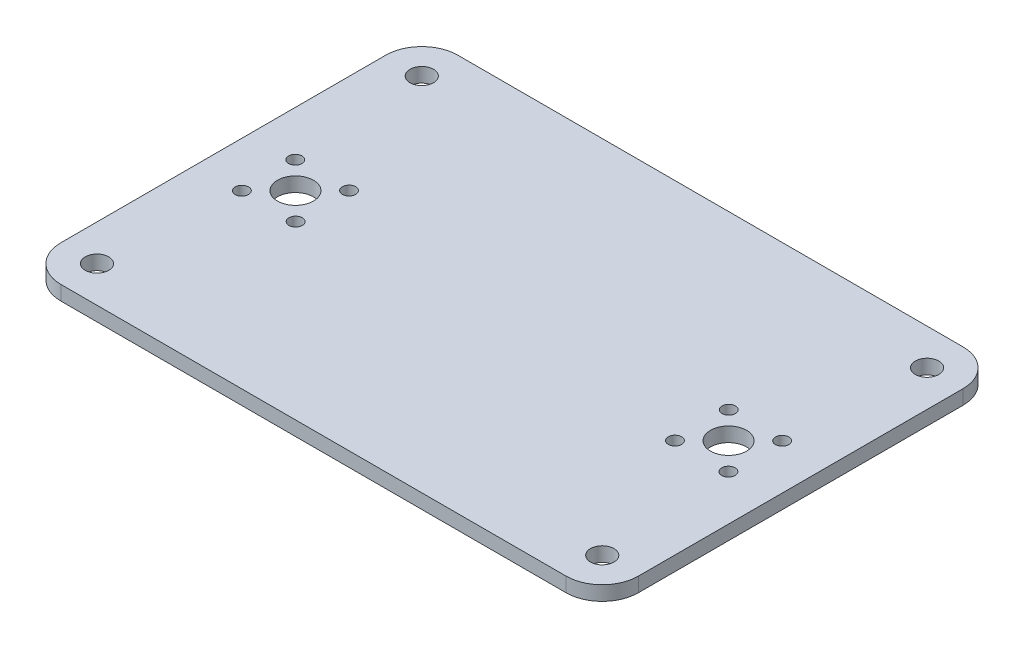
ISO-10303-21;
HEADER;
FILE_DESCRIPTION(('STEP AP214'),'2;1');
FILE_NAME('part.step','',(''),(''),'','','');
FILE_SCHEMA(('AUTOMOTIVE_DESIGN { 1 0 10303 214 1 1 1 1 }'));
ENDSEC;
DATA;
#1=APPLICATION_CONTEXT('core data for automotive mechanical design processes');
#2=APPLICATION_PROTOCOL_DEFINITION('international standard','automotive_design',2000,#1);
#3=PRODUCT_CONTEXT('',#1,'mechanical');
#4=PRODUCT('Part','Part','',(#3));
#5=PRODUCT_RELATED_PRODUCT_CATEGORY('part','',(#4));
#6=PRODUCT_DEFINITION_FORMATION('','',#4);
#7=PRODUCT_DEFINITION_CONTEXT('part definition',#1,'design');
#8=PRODUCT_DEFINITION('design','',#6,#7);
#9=PRODUCT_DEFINITION_SHAPE('','',#8);
#10=(LENGTH_UNIT() NAMED_UNIT(*) SI_UNIT(.MILLI.,.METRE.));
#11=(NAMED_UNIT(*) PLANE_ANGLE_UNIT() SI_UNIT($,.RADIAN.));
#12=(NAMED_UNIT(*) SI_UNIT($,.STERADIAN.) SOLID_ANGLE_UNIT());
#13=UNCERTAINTY_MEASURE_WITH_UNIT(LENGTH_MEASURE(1.E-05),#10,'distance_accuracy_value','');
#14=(GEOMETRIC_REPRESENTATION_CONTEXT(3) GLOBAL_UNCERTAINTY_ASSIGNED_CONTEXT((#13)) GLOBAL_UNIT_ASSIGNED_CONTEXT((#10,
#11,#12)) REPRESENTATION_CONTEXT('',''));
#15=CARTESIAN_POINT('',(0.,0.,0.));
#16=DIRECTION('',(0.,0.,1.));
#17=DIRECTION('',(1.,0.,0.));
#18=AXIS2_PLACEMENT_3D('',#15,#16,#17);
#19=CARTESIAN_POINT('',(0.,4.,-55.));
#20=DIRECTION('',(0.,0.,1.));
#21=DIRECTION('',(1.,0.,0.));
#22=AXIS2_PLACEMENT_3D('',#19,#20,#21);
#23=PLANE('',#22);
#24=DIRECTION('',(-1.,0.,0.));
#25=VECTOR('',#24,1.);
#26=CARTESIAN_POINT('',(0.,0.,-55.));
#27=LINE('',#26,#25);
#28=CARTESIAN_POINT('',(69.9999999999999,0.,-55.));
#29=VERTEX_POINT('',#28);
#30=CARTESIAN_POINT('',(-70.,0.,-55.));
#31=VERTEX_POINT('',#30);
#32=EDGE_CURVE('E185',#29,#31,#27,.T.);
#33=ORIENTED_EDGE('',*,*,#32,.T.);
#34=DIRECTION('',(0.,-1.,0.));
#35=VECTOR('',#34,1.);
#36=CARTESIAN_POINT('',(-70.,4.,-55.));
#37=LINE('',#36,#35);
#38=CARTESIAN_POINT('',(-70.,4.,-55.));
#39=VERTEX_POINT('',#38);
#40=EDGE_CURVE('E13',#39,#31,#37,.T.);
#41=ORIENTED_EDGE('',*,*,#40,.F.);
#42=DIRECTION('',(-1.,0.,0.));
#43=VECTOR('',#42,1.);
#44=CARTESIAN_POINT('',(0.,4.,-55.));
#45=LINE('',#44,#43);
#46=CARTESIAN_POINT('',(69.9999999999999,4.,-55.));
#47=VERTEX_POINT('',#46);
#48=EDGE_CURVE('E234',#47,#39,#45,.T.);
#49=ORIENTED_EDGE('',*,*,#48,.F.);
#50=DIRECTION('',(0.,-1.,0.));
#51=VECTOR('',#50,1.);
#52=CARTESIAN_POINT('',(69.9999999999999,4.,-55.));
#53=LINE('',#52,#51);
#54=EDGE_CURVE('E145',#47,#29,#53,.T.);
#55=ORIENTED_EDGE('',*,*,#54,.T.);
#56=EDGE_LOOP('',(#33,#41,#49,#55));
#57=FACE_BOUND('',#56,.T.);
#58=ADVANCED_FACE('F46',(#57),#23,.F.);
#59=CARTESIAN_POINT('',(-70.,4.,-45.));
#60=DIRECTION('',(0.,-1.,0.));
#61=DIRECTION('',(0.,0.,-1.));
#62=AXIS2_PLACEMENT_3D('',#59,#60,#61);
#63=CYLINDRICAL_SURFACE('',#62,10.);
#64=CARTESIAN_POINT('',(-70.,0.,-45.));
#65=DIRECTION('',(0.,1.,0.));
#66=DIRECTION('',(0.,0.,1.));
#67=AXIS2_PLACEMENT_3D('',#64,#65,#66);
#68=CIRCLE('',#67,10.);
#69=CARTESIAN_POINT('',(-80.,0.,-44.9999999999999));
#70=VERTEX_POINT('',#69);
#71=EDGE_CURVE('E188',#31,#70,#68,.T.);
#72=ORIENTED_EDGE('',*,*,#71,.T.);
#73=DIRECTION('',(0.,-1.,0.));
#74=VECTOR('',#73,1.);
#75=CARTESIAN_POINT('',(-80.,4.,-44.9999999999999));
#76=LINE('',#75,#74);
#77=CARTESIAN_POINT('',(-80.,4.,-44.9999999999999));
#78=VERTEX_POINT('',#77);
#79=EDGE_CURVE('E55',#78,#70,#76,.T.);
#80=ORIENTED_EDGE('',*,*,#79,.F.);
#81=CARTESIAN_POINT('',(-70.,4.,-45.));
#82=DIRECTION('',(0.,1.,0.));
#83=DIRECTION('',(0.,0.,1.));
#84=AXIS2_PLACEMENT_3D('',#81,#82,#83);
#85=CIRCLE('',#84,10.);
#86=EDGE_CURVE('E106',#39,#78,#85,.T.);
#87=ORIENTED_EDGE('',*,*,#86,.F.);
#88=ORIENTED_EDGE('',*,*,#40,.T.);
#89=EDGE_LOOP('',(#72,#80,#87,#88));
#90=FACE_BOUND('',#89,.T.);
#91=ADVANCED_FACE('F219',(#90),#63,.T.);
#92=CARTESIAN_POINT('',(-80.,4.,0.));
#93=DIRECTION('',(-1.,0.,0.));
#94=DIRECTION('',(0.,0.,1.));
#95=AXIS2_PLACEMENT_3D('',#92,#93,#94);
#96=PLANE('',#95);
#97=DIRECTION('',(0.,0.,-1.));
#98=VECTOR('',#97,1.);
#99=CARTESIAN_POINT('',(-80.,0.,0.));
#100=LINE('',#99,#98);
#101=CARTESIAN_POINT('',(-80.,0.,44.9999999999999));
#102=VERTEX_POINT('',#101);
#103=EDGE_CURVE('E191',#102,#70,#100,.T.);
#104=ORIENTED_EDGE('',*,*,#103,.F.);
#105=DIRECTION('',(0.,-1.,0.));
#106=VECTOR('',#105,1.);
#107=CARTESIAN_POINT('',(-80.,4.,44.9999999999999));
#108=LINE('',#107,#106);
#109=CARTESIAN_POINT('',(-80.,4.,44.9999999999999));
#110=VERTEX_POINT('',#109);
#111=EDGE_CURVE('E212',#110,#102,#108,.T.);
#112=ORIENTED_EDGE('',*,*,#111,.F.);
#113=DIRECTION('',(0.,0.,-1.));
#114=VECTOR('',#113,1.);
#115=CARTESIAN_POINT('',(-80.,4.,0.));
#116=LINE('',#115,#114);
#117=EDGE_CURVE('E218',#110,#78,#116,.T.);
#118=ORIENTED_EDGE('',*,*,#117,.T.);
#119=ORIENTED_EDGE('',*,*,#79,.T.);
#120=EDGE_LOOP('',(#104,#112,#118,#119));
#121=FACE_BOUND('',#120,.T.);
#122=ADVANCED_FACE('F216',(#121),#96,.T.);
#123=CARTESIAN_POINT('',(-70.,4.,45.));
#124=DIRECTION('',(0.,-1.,0.));
#125=DIRECTION('',(0.,0.,-1.));
#126=AXIS2_PLACEMENT_3D('',#123,#124,#125);
#127=CYLINDRICAL_SURFACE('',#126,10.);
#128=CARTESIAN_POINT('',(-70.,0.,45.));
#129=DIRECTION('',(0.,1.,0.));
#130=DIRECTION('',(0.,0.,1.));
#131=AXIS2_PLACEMENT_3D('',#128,#129,#130);
#132=CIRCLE('',#131,10.);
#133=CARTESIAN_POINT('',(-70.,0.,55.));
#134=VERTEX_POINT('',#133);
#135=EDGE_CURVE('E194',#102,#134,#132,.T.);
#136=ORIENTED_EDGE('',*,*,#135,.T.);
#137=DIRECTION('',(0.,-1.,0.));
#138=VECTOR('',#137,1.);
#139=CARTESIAN_POINT('',(-70.,4.,55.));
#140=LINE('',#139,#138);
#141=CARTESIAN_POINT('',(-70.,4.,55.));
#142=VERTEX_POINT('',#141);
#143=EDGE_CURVE('E210',#142,#134,#140,.T.);
#144=ORIENTED_EDGE('',*,*,#143,.F.);
#145=CARTESIAN_POINT('',(-70.,4.,45.));
#146=DIRECTION('',(0.,1.,0.));
#147=DIRECTION('',(0.,0.,1.));
#148=AXIS2_PLACEMENT_3D('',#145,#146,#147);
#149=CIRCLE('',#148,10.);
#150=EDGE_CURVE('E231',#110,#142,#149,.T.);
#151=ORIENTED_EDGE('',*,*,#150,.F.);
#152=ORIENTED_EDGE('',*,*,#111,.T.);
#153=EDGE_LOOP('',(#136,#144,#151,#152));
#154=FACE_BOUND('',#153,.T.);
#155=ADVANCED_FACE('F229',(#154),#127,.T.);
#156=CARTESIAN_POINT('',(0.,4.,55.));
#157=DIRECTION('',(0.,0.,1.));
#158=DIRECTION('',(1.,0.,0.));
#159=AXIS2_PLACEMENT_3D('',#156,#157,#158);
#160=PLANE('',#159);
#161=DIRECTION('',(-1.,0.,0.));
#162=VECTOR('',#161,1.);
#163=CARTESIAN_POINT('',(0.,0.,55.));
#164=LINE('',#163,#162);
#165=CARTESIAN_POINT('',(69.9999999999999,0.,55.));
#166=VERTEX_POINT('',#165);
#167=EDGE_CURVE('E197',#166,#134,#164,.T.);
#168=ORIENTED_EDGE('',*,*,#167,.F.);
#169=DIRECTION('',(0.,-1.,0.));
#170=VECTOR('',#169,1.);
#171=CARTESIAN_POINT('',(69.9999999999999,4.,55.));
#172=LINE('',#171,#170);
#173=CARTESIAN_POINT('',(69.9999999999999,4.,55.));
#174=VERTEX_POINT('',#173);
#175=EDGE_CURVE('E134',#174,#166,#172,.T.);
#176=ORIENTED_EDGE('',*,*,#175,.F.);
#177=DIRECTION('',(-1.,0.,0.));
#178=VECTOR('',#177,1.);
#179=CARTESIAN_POINT('',(0.,4.,55.));
#180=LINE('',#179,#178);
#181=EDGE_CURVE('E127',#174,#142,#180,.T.);
#182=ORIENTED_EDGE('',*,*,#181,.T.);
#183=ORIENTED_EDGE('',*,*,#143,.T.);
#184=EDGE_LOOP('',(#168,#176,#182,#183));
#185=FACE_BOUND('',#184,.T.);
#186=ADVANCED_FACE('F238',(#185),#160,.T.);
#187=CARTESIAN_POINT('',(70.,4.,45.));
#188=DIRECTION('',(0.,-1.,0.));
#189=DIRECTION('',(0.,0.,-1.));
#190=AXIS2_PLACEMENT_3D('',#187,#188,#189);
#191=CYLINDRICAL_SURFACE('',#190,10.);
#192=CARTESIAN_POINT('',(70.,0.,45.));
#193=DIRECTION('',(0.,1.,0.));
#194=DIRECTION('',(0.,0.,1.));
#195=AXIS2_PLACEMENT_3D('',#192,#193,#194);
#196=CIRCLE('',#195,10.);
#197=CARTESIAN_POINT('',(80.,0.,44.9999999999999));
#198=VERTEX_POINT('',#197);
#199=EDGE_CURVE('E133',#166,#198,#196,.T.);
#200=ORIENTED_EDGE('',*,*,#199,.T.);
#201=DIRECTION('',(0.,-1.,0.));
#202=VECTOR('',#201,1.);
#203=CARTESIAN_POINT('',(80.,4.,44.9999999999999));
#204=LINE('',#203,#202);
#205=CARTESIAN_POINT('',(80.,4.,44.9999999999999));
#206=VERTEX_POINT('',#205);
#207=EDGE_CURVE('E130',#206,#198,#204,.T.);
#208=ORIENTED_EDGE('',*,*,#207,.F.);
#209=CARTESIAN_POINT('',(70.,4.,45.));
#210=DIRECTION('',(0.,1.,0.));
#211=DIRECTION('',(0.,0.,1.));
#212=AXIS2_PLACEMENT_3D('',#209,#210,#211);
#213=CIRCLE('',#212,10.);
#214=EDGE_CURVE('E120',#174,#206,#213,.T.);
#215=ORIENTED_EDGE('',*,*,#214,.F.);
#216=ORIENTED_EDGE('',*,*,#175,.T.);
#217=EDGE_LOOP('',(#200,#208,#215,#216));
#218=FACE_BOUND('',#217,.T.);
#219=ADVANCED_FACE('F131',(#218),#191,.T.);
#220=CARTESIAN_POINT('',(80.,4.,0.));
#221=DIRECTION('',(-1.,0.,0.));
#222=DIRECTION('',(0.,0.,1.));
#223=AXIS2_PLACEMENT_3D('',#220,#221,#222);
#224=PLANE('',#223);
#225=DIRECTION('',(0.,0.,-1.));
#226=VECTOR('',#225,1.);
#227=CARTESIAN_POINT('',(80.,0.,0.));
#228=LINE('',#227,#226);
#229=CARTESIAN_POINT('',(80.,0.,-45.));
#230=VERTEX_POINT('',#229);
#231=EDGE_CURVE('E92',#198,#230,#228,.T.);
#232=ORIENTED_EDGE('',*,*,#231,.T.);
#233=DIRECTION('',(0.,-1.,0.));
#234=VECTOR('',#233,1.);
#235=CARTESIAN_POINT('',(80.,4.,-45.));
#236=LINE('',#235,#234);
#237=CARTESIAN_POINT('',(80.,4.,-45.));
#238=VERTEX_POINT('',#237);
#239=EDGE_CURVE('E135',#238,#230,#236,.T.);
#240=ORIENTED_EDGE('',*,*,#239,.F.);
#241=DIRECTION('',(0.,0.,-1.));
#242=VECTOR('',#241,1.);
#243=CARTESIAN_POINT('',(80.,4.,0.));
#244=LINE('',#243,#242);
#245=EDGE_CURVE('E125',#206,#238,#244,.T.);
#246=ORIENTED_EDGE('',*,*,#245,.F.);
#247=ORIENTED_EDGE('',*,*,#207,.T.);
#248=EDGE_LOOP('',(#232,#240,#246,#247));
#249=FACE_BOUND('',#248,.T.);
#250=ADVANCED_FACE('F137',(#249),#224,.F.);
#251=CARTESIAN_POINT('',(70.,4.,-45.));
#252=DIRECTION('',(0.,-1.,0.));
#253=DIRECTION('',(0.,0.,-1.));
#254=AXIS2_PLACEMENT_3D('',#251,#252,#253);
#255=CYLINDRICAL_SURFACE('',#254,10.);
#256=CARTESIAN_POINT('',(70.,0.,-45.));
#257=DIRECTION('',(0.,1.,0.));
#258=DIRECTION('',(0.,0.,1.));
#259=AXIS2_PLACEMENT_3D('',#256,#257,#258);
#260=CIRCLE('',#259,10.);
#261=EDGE_CURVE('E98',#230,#29,#260,.T.);
#262=ORIENTED_EDGE('',*,*,#261,.T.);
#263=ORIENTED_EDGE('',*,*,#54,.F.);
#264=CARTESIAN_POINT('',(70.,4.,-45.));
#265=DIRECTION('',(0.,1.,0.));
#266=DIRECTION('',(0.,0.,1.));
#267=AXIS2_PLACEMENT_3D('',#264,#265,#266);
#268=CIRCLE('',#267,10.);
#269=EDGE_CURVE('E63',#238,#47,#268,.T.);
#270=ORIENTED_EDGE('',*,*,#269,.F.);
#271=ORIENTED_EDGE('',*,*,#239,.T.);
#272=EDGE_LOOP('',(#262,#263,#270,#271));
#273=FACE_BOUND('',#272,.T.);
#274=ADVANCED_FACE('F241',(#273),#255,.T.);
#275=CARTESIAN_POINT('',(60.,4.,0.));
#276=DIRECTION('',(0.,-1.,0.));
#277=DIRECTION('',(0.,0.,-1.));
#278=AXIS2_PLACEMENT_3D('',#275,#276,#277);
#279=CYLINDRICAL_SURFACE('',#278,5.);
#280=CARTESIAN_POINT('',(60.,4.,0.));
#281=DIRECTION('',(0.,1.,0.));
#282=DIRECTION('',(0.,0.,1.));
#283=AXIS2_PLACEMENT_3D('',#280,#281,#282);
#284=CIRCLE('',#283,5.);
#285=CARTESIAN_POINT('',(60.,4.,4.99999999999997));
#286=VERTEX_POINT('',#285);
#287=EDGE_CURVE('E557',#286,#286,#284,.F.);
#288=ORIENTED_EDGE('',*,*,#287,.F.);
#289=EDGE_LOOP('',(#288));
#290=FACE_BOUND('',#289,.T.);
#291=CARTESIAN_POINT('',(60.,0.,0.));
#292=DIRECTION('',(0.,1.,0.));
#293=DIRECTION('',(0.,0.,1.));
#294=AXIS2_PLACEMENT_3D('',#291,#292,#293);
#295=CIRCLE('',#294,5.);
#296=CARTESIAN_POINT('',(60.,0.,4.99999999999997));
#297=VERTEX_POINT('',#296);
#298=EDGE_CURVE('E182',#297,#297,#295,.F.);
#299=ORIENTED_EDGE('',*,*,#298,.T.);
#300=EDGE_LOOP('',(#299));
#301=FACE_BOUND('',#300,.T.);
#302=ADVANCED_FACE('F243',(#290,#301),#279,.F.);
#303=CARTESIAN_POINT('',(52.5533596668064,4.,7.40253657525944));
#304=DIRECTION('',(0.,-1.,0.));
#305=DIRECTION('',(0.,0.,-1.));
#306=AXIS2_PLACEMENT_3D('',#303,#304,#305);
#307=CYLINDRICAL_SURFACE('',#306,1.85);
#308=CARTESIAN_POINT('',(52.5533596668064,4.,7.40253657525944));
#309=DIRECTION('',(0.,1.,0.));
#310=DIRECTION('',(0.,0.,1.));
#311=AXIS2_PLACEMENT_3D('',#308,#309,#310);
#312=CIRCLE('',#311,1.85);
#313=CARTESIAN_POINT('',(52.5533596668064,4.,9.25253657525944));
#314=VERTEX_POINT('',#313);
#315=EDGE_CURVE('E554',#314,#314,#312,.F.);
#316=ORIENTED_EDGE('',*,*,#315,.F.);
#317=EDGE_LOOP('',(#316));
#318=FACE_BOUND('',#317,.T.);
#319=CARTESIAN_POINT('',(52.5533596668064,0.,7.40253657525944));
#320=DIRECTION('',(0.,1.,0.));
#321=DIRECTION('',(0.,0.,1.));
#322=AXIS2_PLACEMENT_3D('',#319,#320,#321);
#323=CIRCLE('',#322,1.85);
#324=CARTESIAN_POINT('',(52.5533596668064,0.,9.25253657525944));
#325=VERTEX_POINT('',#324);
#326=EDGE_CURVE('E179',#325,#325,#323,.F.);
#327=ORIENTED_EDGE('',*,*,#326,.T.);
#328=EDGE_LOOP('',(#327));
#329=FACE_BOUND('',#328,.T.);
#330=ADVANCED_FACE('F249',(#318,#329),#307,.F.);
#331=CARTESIAN_POINT('',(-52.5533596668064,4.,7.40253657525945));
#332=DIRECTION('',(0.,-1.,0.));
#333=DIRECTION('',(0.,0.,-1.));
#334=AXIS2_PLACEMENT_3D('',#331,#332,#333);
#335=CYLINDRICAL_SURFACE('',#334,1.85);
#336=CARTESIAN_POINT('',(-52.5533596668064,4.,7.40253657525945));
#337=DIRECTION('',(0.,1.,0.));
#338=DIRECTION('',(0.,0.,1.));
#339=AXIS2_PLACEMENT_3D('',#336,#337,#338);
#340=CIRCLE('',#339,1.85);
#341=CARTESIAN_POINT('',(-52.5533596668064,4.,9.25253657525945));
#342=VERTEX_POINT('',#341);
#343=EDGE_CURVE('E550',#342,#342,#340,.T.);
#344=ORIENTED_EDGE('',*,*,#343,.T.);
#345=EDGE_LOOP('',(#344));
#346=FACE_BOUND('',#345,.T.);
#347=CARTESIAN_POINT('',(-52.5533596668064,0.,7.40253657525945));
#348=DIRECTION('',(0.,1.,0.));
#349=DIRECTION('',(0.,0.,1.));
#350=AXIS2_PLACEMENT_3D('',#347,#348,#349);
#351=CIRCLE('',#350,1.85);
#352=CARTESIAN_POINT('',(-52.5533596668064,0.,9.25253657525945));
#353=VERTEX_POINT('',#352);
#354=EDGE_CURVE('E176',#353,#353,#351,.T.);
#355=ORIENTED_EDGE('',*,*,#354,.F.);
#356=EDGE_LOOP('',(#355));
#357=FACE_BOUND('',#356,.T.);
#358=ADVANCED_FACE('F264',(#346,#357),#335,.F.);
#359=CARTESIAN_POINT('',(52.5974634247404,4.,-7.44664033319365));
#360=DIRECTION('',(0.,-1.,0.));
#361=DIRECTION('',(0.,0.,-1.));
#362=AXIS2_PLACEMENT_3D('',#359,#360,#361);
#363=CYLINDRICAL_SURFACE('',#362,1.85);
#364=CARTESIAN_POINT('',(52.5974634247404,4.,-7.44664033319365));
#365=DIRECTION('',(0.,1.,0.));
#366=DIRECTION('',(0.,0.,1.));
#367=AXIS2_PLACEMENT_3D('',#364,#365,#366);
#368=CIRCLE('',#367,1.85);
#369=CARTESIAN_POINT('',(52.5974634247404,4.,-5.59664033319365));
#370=VERTEX_POINT('',#369);
#371=EDGE_CURVE('E546',#370,#370,#368,.F.);
#372=ORIENTED_EDGE('',*,*,#371,.F.);
#373=EDGE_LOOP('',(#372));
#374=FACE_BOUND('',#373,.T.);
#375=CARTESIAN_POINT('',(52.5974634247404,0.,-7.44664033319365));
#376=DIRECTION('',(0.,1.,0.));
#377=DIRECTION('',(0.,0.,1.));
#378=AXIS2_PLACEMENT_3D('',#375,#376,#377);
#379=CIRCLE('',#378,1.85);
#380=CARTESIAN_POINT('',(52.5974634247404,0.,-5.59664033319365));
#381=VERTEX_POINT('',#380);
#382=EDGE_CURVE('E173',#381,#381,#379,.F.);
#383=ORIENTED_EDGE('',*,*,#382,.T.);
#384=EDGE_LOOP('',(#383));
#385=FACE_BOUND('',#384,.T.);
#386=ADVANCED_FACE('F268',(#374,#385),#363,.F.);
#387=CARTESIAN_POINT('',(67.4025365752595,4.,7.44664033319332));
#388=DIRECTION('',(0.,-1.,0.));
#389=DIRECTION('',(0.,0.,-1.));
#390=AXIS2_PLACEMENT_3D('',#387,#388,#389);
#391=CYLINDRICAL_SURFACE('',#390,1.85);
#392=CARTESIAN_POINT('',(67.4025365752595,4.,7.44664033319332));
#393=DIRECTION('',(0.,1.,0.));
#394=DIRECTION('',(0.,0.,1.));
#395=AXIS2_PLACEMENT_3D('',#392,#393,#394);
#396=CIRCLE('',#395,1.85);
#397=CARTESIAN_POINT('',(67.4025365752595,4.,9.29664033319332));
#398=VERTEX_POINT('',#397);
#399=EDGE_CURVE('E542',#398,#398,#396,.F.);
#400=ORIENTED_EDGE('',*,*,#399,.F.);
#401=EDGE_LOOP('',(#400));
#402=FACE_BOUND('',#401,.T.);
#403=CARTESIAN_POINT('',(67.4025365752595,0.,7.44664033319332));
#404=DIRECTION('',(0.,1.,0.));
#405=DIRECTION('',(0.,0.,1.));
#406=AXIS2_PLACEMENT_3D('',#403,#404,#405);
#407=CIRCLE('',#406,1.85);
#408=CARTESIAN_POINT('',(67.4025365752595,0.,9.29664033319332));
#409=VERTEX_POINT('',#408);
#410=EDGE_CURVE('E170',#409,#409,#407,.F.);
#411=ORIENTED_EDGE('',*,*,#410,.T.);
#412=EDGE_LOOP('',(#411));
#413=FACE_BOUND('',#412,.T.);
#414=ADVANCED_FACE('F272',(#402,#413),#391,.F.);
#415=CARTESIAN_POINT('',(67.4466403331934,4.,-7.40253657525965));
#416=DIRECTION('',(0.,-1.,0.));
#417=DIRECTION('',(0.,0.,-1.));
#418=AXIS2_PLACEMENT_3D('',#415,#416,#417);
#419=CYLINDRICAL_SURFACE('',#418,1.85);
#420=CARTESIAN_POINT('',(67.4466403331934,4.,-7.40253657525965));
#421=DIRECTION('',(0.,1.,0.));
#422=DIRECTION('',(0.,0.,1.));
#423=AXIS2_PLACEMENT_3D('',#420,#421,#422);
#424=CIRCLE('',#423,1.85);
#425=CARTESIAN_POINT('',(67.4466403331934,4.,-5.55253657525965));
#426=VERTEX_POINT('',#425);
#427=EDGE_CURVE('E538',#426,#426,#424,.F.);
#428=ORIENTED_EDGE('',*,*,#427,.F.);
#429=EDGE_LOOP('',(#428));
#430=FACE_BOUND('',#429,.T.);
#431=CARTESIAN_POINT('',(67.4466403331934,0.,-7.40253657525965));
#432=DIRECTION('',(0.,1.,0.));
#433=DIRECTION('',(0.,0.,1.));
#434=AXIS2_PLACEMENT_3D('',#431,#432,#433);
#435=CIRCLE('',#434,1.85);
#436=CARTESIAN_POINT('',(67.4466403331934,0.,-5.55253657525965));
#437=VERTEX_POINT('',#436);
#438=EDGE_CURVE('E167',#437,#437,#435,.F.);
#439=ORIENTED_EDGE('',*,*,#438,.T.);
#440=EDGE_LOOP('',(#439));
#441=FACE_BOUND('',#440,.T.);
#442=ADVANCED_FACE('F276',(#430,#441),#419,.F.);
#443=CARTESIAN_POINT('',(-70.,4.,-45.));
#444=DIRECTION('',(0.,-1.,0.));
#445=DIRECTION('',(0.,0.,-1.));
#446=AXIS2_PLACEMENT_3D('',#443,#444,#445);
#447=CYLINDRICAL_SURFACE('',#446,3.25000000000001);
#448=CARTESIAN_POINT('',(-70.,4.,-45.));
#449=DIRECTION('',(0.,1.,0.));
#450=DIRECTION('',(0.,0.,1.));
#451=AXIS2_PLACEMENT_3D('',#448,#449,#450);
#452=CIRCLE('',#451,3.25000000000001);
#453=CARTESIAN_POINT('',(-70.,4.,-41.75));
#454=VERTEX_POINT('',#453);
#455=EDGE_CURVE('E534',#454,#454,#452,.T.);
#456=ORIENTED_EDGE('',*,*,#455,.T.);
#457=EDGE_LOOP('',(#456));
#458=FACE_BOUND('',#457,.T.);
#459=CARTESIAN_POINT('',(-70.,0.,-45.));
#460=DIRECTION('',(0.,1.,0.));
#461=DIRECTION('',(0.,0.,1.));
#462=AXIS2_PLACEMENT_3D('',#459,#460,#461);
#463=CIRCLE('',#462,3.25000000000001);
#464=CARTESIAN_POINT('',(-70.,0.,-41.75));
#465=VERTEX_POINT('',#464);
#466=EDGE_CURVE('E164',#465,#465,#463,.T.);
#467=ORIENTED_EDGE('',*,*,#466,.F.);
#468=EDGE_LOOP('',(#467));
#469=FACE_BOUND('',#468,.T.);
#470=ADVANCED_FACE('F280',(#458,#469),#447,.F.);
#471=CARTESIAN_POINT('',(-70.,4.,45.));
#472=DIRECTION('',(0.,-1.,0.));
#473=DIRECTION('',(0.,0.,-1.));
#474=AXIS2_PLACEMENT_3D('',#471,#472,#473);
#475=CYLINDRICAL_SURFACE('',#474,3.25000000000001);
#476=CARTESIAN_POINT('',(-70.,4.,45.));
#477=DIRECTION('',(0.,1.,0.));
#478=DIRECTION('',(0.,0.,1.));
#479=AXIS2_PLACEMENT_3D('',#476,#477,#478);
#480=CIRCLE('',#479,3.25000000000001);
#481=CARTESIAN_POINT('',(-70.,4.,48.25));
#482=VERTEX_POINT('',#481);
#483=EDGE_CURVE('E530',#482,#482,#480,.T.);
#484=ORIENTED_EDGE('',*,*,#483,.T.);
#485=EDGE_LOOP('',(#484));
#486=FACE_BOUND('',#485,.T.);
#487=CARTESIAN_POINT('',(-70.,0.,45.));
#488=DIRECTION('',(0.,1.,0.));
#489=DIRECTION('',(0.,0.,1.));
#490=AXIS2_PLACEMENT_3D('',#487,#488,#489);
#491=CIRCLE('',#490,3.25000000000001);
#492=CARTESIAN_POINT('',(-70.,0.,48.25));
#493=VERTEX_POINT('',#492);
#494=EDGE_CURVE('E161',#493,#493,#491,.T.);
#495=ORIENTED_EDGE('',*,*,#494,.F.);
#496=EDGE_LOOP('',(#495));
#497=FACE_BOUND('',#496,.T.);
#498=ADVANCED_FACE('F284',(#486,#497),#475,.F.);
#499=CARTESIAN_POINT('',(70.,4.,45.));
#500=DIRECTION('',(0.,-1.,0.));
#501=DIRECTION('',(0.,0.,-1.));
#502=AXIS2_PLACEMENT_3D('',#499,#500,#501);
#503=CYLINDRICAL_SURFACE('',#502,3.25000000000001);
#504=CARTESIAN_POINT('',(70.,4.,45.));
#505=DIRECTION('',(0.,1.,0.));
#506=DIRECTION('',(0.,0.,1.));
#507=AXIS2_PLACEMENT_3D('',#504,#505,#506);
#508=CIRCLE('',#507,3.25000000000001);
#509=CARTESIAN_POINT('',(70.,4.,48.25));
#510=VERTEX_POINT('',#509);
#511=EDGE_CURVE('E526',#510,#510,#508,.T.);
#512=ORIENTED_EDGE('',*,*,#511,.T.);
#513=EDGE_LOOP('',(#512));
#514=FACE_BOUND('',#513,.T.);
#515=CARTESIAN_POINT('',(70.,0.,45.));
#516=DIRECTION('',(0.,1.,0.));
#517=DIRECTION('',(0.,0.,1.));
#518=AXIS2_PLACEMENT_3D('',#515,#516,#517);
#519=CIRCLE('',#518,3.25000000000001);
#520=CARTESIAN_POINT('',(70.,0.,48.25));
#521=VERTEX_POINT('',#520);
#522=EDGE_CURVE('E158',#521,#521,#519,.T.);
#523=ORIENTED_EDGE('',*,*,#522,.F.);
#524=EDGE_LOOP('',(#523));
#525=FACE_BOUND('',#524,.T.);
#526=ADVANCED_FACE('F288',(#514,#525),#503,.F.);
#527=CARTESIAN_POINT('',(70.,4.,-45.));
#528=DIRECTION('',(0.,-1.,0.));
#529=DIRECTION('',(0.,0.,-1.));
#530=AXIS2_PLACEMENT_3D('',#527,#528,#529);
#531=CYLINDRICAL_SURFACE('',#530,3.25000000000001);
#532=CARTESIAN_POINT('',(70.,4.,-45.));
#533=DIRECTION('',(0.,1.,0.));
#534=DIRECTION('',(0.,0.,1.));
#535=AXIS2_PLACEMENT_3D('',#532,#533,#534);
#536=CIRCLE('',#535,3.25000000000001);
#537=CARTESIAN_POINT('',(70.,4.,-41.75));
#538=VERTEX_POINT('',#537);
#539=EDGE_CURVE('E522',#538,#538,#536,.T.);
#540=ORIENTED_EDGE('',*,*,#539,.T.);
#541=EDGE_LOOP('',(#540));
#542=FACE_BOUND('',#541,.T.);
#543=CARTESIAN_POINT('',(70.,0.,-45.));
#544=DIRECTION('',(0.,1.,0.));
#545=DIRECTION('',(0.,0.,1.));
#546=AXIS2_PLACEMENT_3D('',#543,#544,#545);
#547=CIRCLE('',#546,3.25000000000001);
#548=CARTESIAN_POINT('',(70.,0.,-41.75));
#549=VERTEX_POINT('',#548);
#550=EDGE_CURVE('E155',#549,#549,#547,.T.);
#551=ORIENTED_EDGE('',*,*,#550,.F.);
#552=EDGE_LOOP('',(#551));
#553=FACE_BOUND('',#552,.T.);
#554=ADVANCED_FACE('F292',(#542,#553),#531,.F.);
#555=CARTESIAN_POINT('',(-52.5974634247404,4.,-7.44664033319366));
#556=DIRECTION('',(0.,-1.,0.));
#557=DIRECTION('',(0.,0.,-1.));
#558=AXIS2_PLACEMENT_3D('',#555,#556,#557);
#559=CYLINDRICAL_SURFACE('',#558,1.85);
#560=CARTESIAN_POINT('',(-52.5974634247404,4.,-7.44664033319366));
#561=DIRECTION('',(0.,1.,0.));
#562=DIRECTION('',(0.,0.,1.));
#563=AXIS2_PLACEMENT_3D('',#560,#561,#562);
#564=CIRCLE('',#563,1.85);
#565=CARTESIAN_POINT('',(-52.5974634247404,4.,-5.59664033319365));
#566=VERTEX_POINT('',#565);
#567=EDGE_CURVE('E518',#566,#566,#564,.T.);
#568=ORIENTED_EDGE('',*,*,#567,.T.);
#569=EDGE_LOOP('',(#568));
#570=FACE_BOUND('',#569,.T.);
#571=CARTESIAN_POINT('',(-52.5974634247404,0.,-7.44664033319366));
#572=DIRECTION('',(0.,1.,0.));
#573=DIRECTION('',(0.,0.,1.));
#574=AXIS2_PLACEMENT_3D('',#571,#572,#573);
#575=CIRCLE('',#574,1.85);
#576=CARTESIAN_POINT('',(-52.5974634247404,0.,-5.59664033319365));
#577=VERTEX_POINT('',#576);
#578=EDGE_CURVE('E152',#577,#577,#575,.T.);
#579=ORIENTED_EDGE('',*,*,#578,.F.);
#580=EDGE_LOOP('',(#579));
#581=FACE_BOUND('',#580,.T.);
#582=ADVANCED_FACE('F296',(#570,#581),#559,.F.);
#583=CARTESIAN_POINT('',(-67.4466403331935,4.,-7.40253657525966));
#584=DIRECTION('',(0.,-1.,0.));
#585=DIRECTION('',(0.,0.,-1.));
#586=AXIS2_PLACEMENT_3D('',#583,#584,#585);
#587=CYLINDRICAL_SURFACE('',#586,1.85);
#588=CARTESIAN_POINT('',(-67.4466403331935,4.,-7.40253657525966));
#589=DIRECTION('',(0.,1.,0.));
#590=DIRECTION('',(0.,0.,1.));
#591=AXIS2_PLACEMENT_3D('',#588,#589,#590);
#592=CIRCLE('',#591,1.85);
#593=CARTESIAN_POINT('',(-67.4466403331935,4.,-5.55253657525965));
#594=VERTEX_POINT('',#593);
#595=EDGE_CURVE('E311',#594,#594,#592,.T.);
#596=ORIENTED_EDGE('',*,*,#595,.T.);
#597=EDGE_LOOP('',(#596));
#598=FACE_BOUND('',#597,.T.);
#599=CARTESIAN_POINT('',(-67.4466403331935,0.,-7.40253657525966));
#600=DIRECTION('',(0.,1.,0.));
#601=DIRECTION('',(0.,0.,1.));
#602=AXIS2_PLACEMENT_3D('',#599,#600,#601);
#603=CIRCLE('',#602,1.85);
#604=CARTESIAN_POINT('',(-67.4466403331935,0.,-5.55253657525965));
#605=VERTEX_POINT('',#604);
#606=EDGE_CURVE('E149',#605,#605,#603,.T.);
#607=ORIENTED_EDGE('',*,*,#606,.F.);
#608=EDGE_LOOP('',(#607));
#609=FACE_BOUND('',#608,.T.);
#610=ADVANCED_FACE('F299',(#598,#609),#587,.F.);
#611=CARTESIAN_POINT('',(-67.4025365752595,4.,7.44664033319332));
#612=DIRECTION('',(0.,-1.,0.));
#613=DIRECTION('',(0.,0.,-1.));
#614=AXIS2_PLACEMENT_3D('',#611,#612,#613);
#615=CYLINDRICAL_SURFACE('',#614,1.85);
#616=CARTESIAN_POINT('',(-67.4025365752595,4.,7.44664033319332));
#617=DIRECTION('',(0.,1.,0.));
#618=DIRECTION('',(0.,0.,1.));
#619=AXIS2_PLACEMENT_3D('',#616,#617,#618);
#620=CIRCLE('',#619,1.85);
#621=CARTESIAN_POINT('',(-67.4025365752595,4.,9.29664033319332));
#622=VERTEX_POINT('',#621);
#623=EDGE_CURVE('E206',#622,#622,#620,.T.);
#624=ORIENTED_EDGE('',*,*,#623,.T.);
#625=EDGE_LOOP('',(#624));
#626=FACE_BOUND('',#625,.T.);
#627=CARTESIAN_POINT('',(-67.4025365752595,0.,7.44664033319332));
#628=DIRECTION('',(0.,1.,0.));
#629=DIRECTION('',(0.,0.,1.));
#630=AXIS2_PLACEMENT_3D('',#627,#628,#629);
#631=CIRCLE('',#630,1.85);
#632=CARTESIAN_POINT('',(-67.4025365752595,0.,9.29664033319332));
#633=VERTEX_POINT('',#632);
#634=EDGE_CURVE('E146',#633,#633,#631,.T.);
#635=ORIENTED_EDGE('',*,*,#634,.F.);
#636=EDGE_LOOP('',(#635));
#637=FACE_BOUND('',#636,.T.);
#638=ADVANCED_FACE('F48',(#626,#637),#615,.F.);
#639=CARTESIAN_POINT('',(-60.,4.,0.));
#640=DIRECTION('',(0.,-1.,0.));
#641=DIRECTION('',(0.,0.,-1.));
#642=AXIS2_PLACEMENT_3D('',#639,#640,#641);
#643=CYLINDRICAL_SURFACE('',#642,5.);
#644=CARTESIAN_POINT('',(-60.,4.,0.));
#645=DIRECTION('',(0.,1.,0.));
#646=DIRECTION('',(0.,0.,1.));
#647=AXIS2_PLACEMENT_3D('',#644,#645,#646);
#648=CIRCLE('',#647,5.);
#649=CARTESIAN_POINT('',(-60.,4.,4.99999999999997));
#650=VERTEX_POINT('',#649);
#651=EDGE_CURVE('E139',#650,#650,#648,.T.);
#652=ORIENTED_EDGE('',*,*,#651,.T.);
#653=EDGE_LOOP('',(#652));
#654=FACE_BOUND('',#653,.T.);
#655=CARTESIAN_POINT('',(-60.,0.,0.));
#656=DIRECTION('',(0.,1.,0.));
#657=DIRECTION('',(0.,0.,1.));
#658=AXIS2_PLACEMENT_3D('',#655,#656,#657);
#659=CIRCLE('',#658,5.);
#660=CARTESIAN_POINT('',(-60.,0.,4.99999999999997));
#661=VERTEX_POINT('',#660);
#662=EDGE_CURVE('E203',#661,#661,#659,.T.);
#663=ORIENTED_EDGE('',*,*,#662,.F.);
#664=EDGE_LOOP('',(#663));
#665=FACE_BOUND('',#664,.T.);
#666=ADVANCED_FACE('F306',(#654,#665),#643,.F.);
#667=CARTESIAN_POINT('',(0.,4.,0.));
#668=DIRECTION('',(0.,1.,0.));
#669=DIRECTION('',(0.,0.,1.));
#670=AXIS2_PLACEMENT_3D('',#667,#668,#669);
#671=PLANE('',#670);
#672=ORIENTED_EDGE('',*,*,#623,.F.);
#673=EDGE_LOOP('',(#672));
#674=FACE_BOUND('',#673,.T.);
#675=ORIENTED_EDGE('',*,*,#595,.F.);
#676=EDGE_LOOP('',(#675));
#677=FACE_BOUND('',#676,.T.);
#678=ORIENTED_EDGE('',*,*,#567,.F.);
#679=EDGE_LOOP('',(#678));
#680=FACE_BOUND('',#679,.T.);
#681=ORIENTED_EDGE('',*,*,#539,.F.);
#682=EDGE_LOOP('',(#681));
#683=FACE_BOUND('',#682,.T.);
#684=ORIENTED_EDGE('',*,*,#511,.F.);
#685=EDGE_LOOP('',(#684));
#686=FACE_BOUND('',#685,.T.);
#687=ORIENTED_EDGE('',*,*,#483,.F.);
#688=EDGE_LOOP('',(#687));
#689=FACE_BOUND('',#688,.T.);
#690=ORIENTED_EDGE('',*,*,#455,.F.);
#691=EDGE_LOOP('',(#690));
#692=FACE_BOUND('',#691,.T.);
#693=ORIENTED_EDGE('',*,*,#427,.T.);
#694=EDGE_LOOP('',(#693));
#695=FACE_BOUND('',#694,.T.);
#696=ORIENTED_EDGE('',*,*,#399,.T.);
#697=EDGE_LOOP('',(#696));
#698=FACE_BOUND('',#697,.T.);
#699=ORIENTED_EDGE('',*,*,#371,.T.);
#700=EDGE_LOOP('',(#699));
#701=FACE_BOUND('',#700,.T.);
#702=ORIENTED_EDGE('',*,*,#343,.F.);
#703=EDGE_LOOP('',(#702));
#704=FACE_BOUND('',#703,.T.);
#705=ORIENTED_EDGE('',*,*,#315,.T.);
#706=EDGE_LOOP('',(#705));
#707=FACE_BOUND('',#706,.T.);
#708=ORIENTED_EDGE('',*,*,#287,.T.);
#709=EDGE_LOOP('',(#708));
#710=FACE_BOUND('',#709,.T.);
#711=ORIENTED_EDGE('',*,*,#48,.T.);
#712=ORIENTED_EDGE('',*,*,#86,.T.);
#713=ORIENTED_EDGE('',*,*,#117,.F.);
#714=ORIENTED_EDGE('',*,*,#150,.T.);
#715=ORIENTED_EDGE('',*,*,#181,.F.);
#716=ORIENTED_EDGE('',*,*,#214,.T.);
#717=ORIENTED_EDGE('',*,*,#245,.T.);
#718=ORIENTED_EDGE('',*,*,#269,.T.);
#719=EDGE_LOOP('',(#711,#712,#713,#714,#715,#716,#717,#718));
#720=FACE_BOUND('',#719,.T.);
#721=ORIENTED_EDGE('',*,*,#651,.F.);
#722=EDGE_LOOP('',(#721));
#723=FACE_BOUND('',#722,.T.);
#724=ADVANCED_FACE('F122',(#674,#677,#680,#683,#686,#689,#692,#695,#698,#701,#704,#707,#710,
#720,#723),#671,.T.);
#725=CARTESIAN_POINT('',(0.,0.,0.));
#726=DIRECTION('',(0.,1.,0.));
#727=DIRECTION('',(0.,0.,1.));
#728=AXIS2_PLACEMENT_3D('',#725,#726,#727);
#729=PLANE('',#728);
#730=ORIENTED_EDGE('',*,*,#634,.T.);
#731=EDGE_LOOP('',(#730));
#732=FACE_BOUND('',#731,.T.);
#733=ORIENTED_EDGE('',*,*,#606,.T.);
#734=EDGE_LOOP('',(#733));
#735=FACE_BOUND('',#734,.T.);
#736=ORIENTED_EDGE('',*,*,#578,.T.);
#737=EDGE_LOOP('',(#736));
#738=FACE_BOUND('',#737,.T.);
#739=ORIENTED_EDGE('',*,*,#550,.T.);
#740=EDGE_LOOP('',(#739));
#741=FACE_BOUND('',#740,.T.);
#742=ORIENTED_EDGE('',*,*,#522,.T.);
#743=EDGE_LOOP('',(#742));
#744=FACE_BOUND('',#743,.T.);
#745=ORIENTED_EDGE('',*,*,#494,.T.);
#746=EDGE_LOOP('',(#745));
#747=FACE_BOUND('',#746,.T.);
#748=ORIENTED_EDGE('',*,*,#466,.T.);
#749=EDGE_LOOP('',(#748));
#750=FACE_BOUND('',#749,.T.);
#751=ORIENTED_EDGE('',*,*,#438,.F.);
#752=EDGE_LOOP('',(#751));
#753=FACE_BOUND('',#752,.T.);
#754=ORIENTED_EDGE('',*,*,#410,.F.);
#755=EDGE_LOOP('',(#754));
#756=FACE_BOUND('',#755,.T.);
#757=ORIENTED_EDGE('',*,*,#382,.F.);
#758=EDGE_LOOP('',(#757));
#759=FACE_BOUND('',#758,.T.);
#760=ORIENTED_EDGE('',*,*,#354,.T.);
#761=EDGE_LOOP('',(#760));
#762=FACE_BOUND('',#761,.T.);
#763=ORIENTED_EDGE('',*,*,#326,.F.);
#764=EDGE_LOOP('',(#763));
#765=FACE_BOUND('',#764,.T.);
#766=ORIENTED_EDGE('',*,*,#298,.F.);
#767=EDGE_LOOP('',(#766));
#768=FACE_BOUND('',#767,.T.);
#769=ORIENTED_EDGE('',*,*,#32,.F.);
#770=ORIENTED_EDGE('',*,*,#261,.F.);
#771=ORIENTED_EDGE('',*,*,#231,.F.);
#772=ORIENTED_EDGE('',*,*,#199,.F.);
#773=ORIENTED_EDGE('',*,*,#167,.T.);
#774=ORIENTED_EDGE('',*,*,#135,.F.);
#775=ORIENTED_EDGE('',*,*,#103,.T.);
#776=ORIENTED_EDGE('',*,*,#71,.F.);
#777=EDGE_LOOP('',(#769,#770,#771,#772,#773,#774,#775,#776));
#778=FACE_BOUND('',#777,.T.);
#779=ORIENTED_EDGE('',*,*,#662,.T.);
#780=EDGE_LOOP('',(#779));
#781=FACE_BOUND('',#780,.T.);
#782=ADVANCED_FACE('F224',(#732,#735,#738,#741,#744,#747,#750,#753,#756,#759,#762,#765,#768,
#778,#781),#729,.F.);
#783=CLOSED_SHELL('',(#58,#91,#122,#155,#186,#219,#250,#274,#302,#330,#358,#386,#414,#442,#470,
#498,#526,#554,#582,#610,#638,#666,#724,#782));
#784=MANIFOLD_SOLID_BREP('B2',#783);
#785=ADVANCED_BREP_SHAPE_REPRESENTATION('',(#18,#784),#14);
#786=SHAPE_DEFINITION_REPRESENTATION(#9,#785);
ENDSEC;
END-ISO-10303-21;
